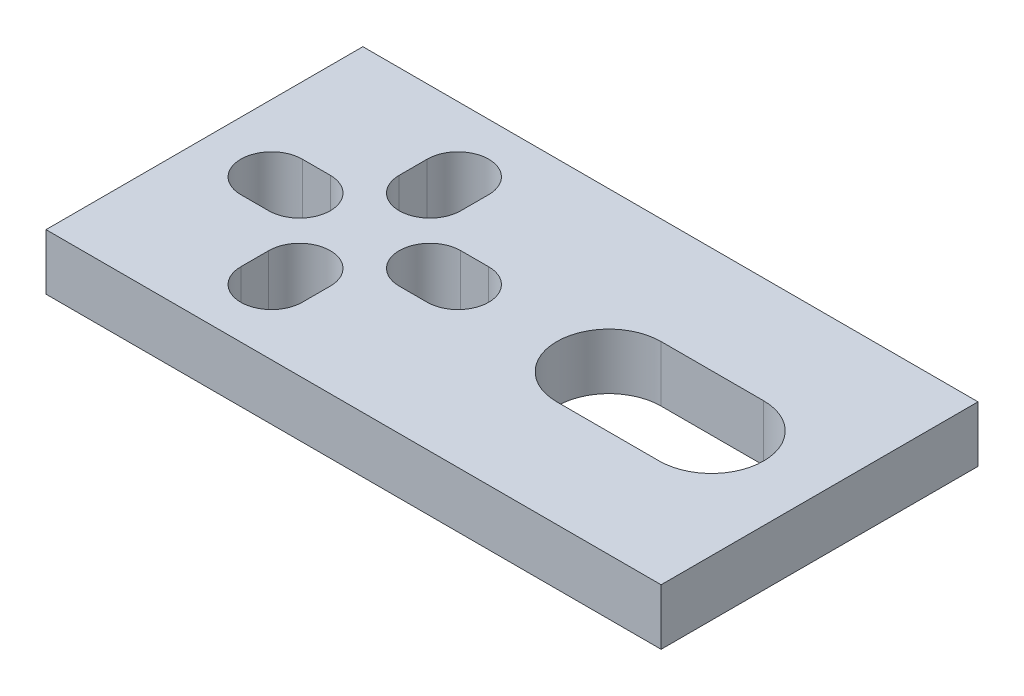
ISO-10303-21;
HEADER;
FILE_DESCRIPTION(('STEP AP214'),'2;1');
FILE_NAME('part.step','',(''),(''),'','','');
FILE_SCHEMA(('AUTOMOTIVE_DESIGN { 1 0 10303 214 1 1 1 1 }'));
ENDSEC;
DATA;
#1=APPLICATION_CONTEXT('core data for automotive mechanical design processes');
#2=APPLICATION_PROTOCOL_DEFINITION('international standard','automotive_design',2000,#1);
#3=PRODUCT_CONTEXT('',#1,'mechanical');
#4=PRODUCT('Part','Part','',(#3));
#5=PRODUCT_RELATED_PRODUCT_CATEGORY('part','',(#4));
#6=PRODUCT_DEFINITION_FORMATION('','',#4);
#7=PRODUCT_DEFINITION_CONTEXT('part definition',#1,'design');
#8=PRODUCT_DEFINITION('design','',#6,#7);
#9=PRODUCT_DEFINITION_SHAPE('','',#8);
#10=(LENGTH_UNIT() NAMED_UNIT(*) SI_UNIT(.MILLI.,.METRE.));
#11=(NAMED_UNIT(*) PLANE_ANGLE_UNIT() SI_UNIT($,.RADIAN.));
#12=(NAMED_UNIT(*) SI_UNIT($,.STERADIAN.) SOLID_ANGLE_UNIT());
#13=UNCERTAINTY_MEASURE_WITH_UNIT(LENGTH_MEASURE(1.E-05),#10,'distance_accuracy_value','');
#14=(GEOMETRIC_REPRESENTATION_CONTEXT(3) GLOBAL_UNCERTAINTY_ASSIGNED_CONTEXT((#13)) GLOBAL_UNIT_ASSIGNED_CONTEXT((#10,
#11,#12)) REPRESENTATION_CONTEXT('',''));
#15=CARTESIAN_POINT('',(0.,0.,0.));
#16=DIRECTION('',(0.,0.,1.));
#17=DIRECTION('',(1.,0.,0.));
#18=AXIS2_PLACEMENT_3D('',#15,#16,#17);
#19=CARTESIAN_POINT('',(0.,3.,0.));
#20=DIRECTION('',(1.,0.,0.));
#21=DIRECTION('',(0.,0.,-1.));
#22=AXIS2_PLACEMENT_3D('',#19,#20,#21);
#23=PLANE('',#22);
#24=DIRECTION('',(0.,0.,1.));
#25=VECTOR('',#24,1.);
#26=CARTESIAN_POINT('',(0.,0.,0.));
#27=LINE('',#26,#25);
#28=CARTESIAN_POINT('',(0.,0.,-17.));
#29=VERTEX_POINT('',#28);
#30=CARTESIAN_POINT('',(0.,0.,0.));
#31=VERTEX_POINT('',#30);
#32=EDGE_CURVE('E353',#29,#31,#27,.T.);
#33=ORIENTED_EDGE('',*,*,#32,.T.);
#34=DIRECTION('',(0.,-1.,0.));
#35=VECTOR('',#34,1.);
#36=CARTESIAN_POINT('',(0.,3.,0.));
#37=LINE('',#36,#35);
#38=CARTESIAN_POINT('',(0.,3.,0.));
#39=VERTEX_POINT('',#38);
#40=EDGE_CURVE('E11',#39,#31,#37,.T.);
#41=ORIENTED_EDGE('',*,*,#40,.F.);
#42=DIRECTION('',(0.,0.,1.));
#43=VECTOR('',#42,1.);
#44=CARTESIAN_POINT('',(0.,3.,0.));
#45=LINE('',#44,#43);
#46=CARTESIAN_POINT('',(0.,3.,-17.));
#47=VERTEX_POINT('',#46);
#48=EDGE_CURVE('E360',#47,#39,#45,.T.);
#49=ORIENTED_EDGE('',*,*,#48,.F.);
#50=DIRECTION('',(0.,-1.,0.));
#51=VECTOR('',#50,1.);
#52=CARTESIAN_POINT('',(0.,3.,-17.));
#53=LINE('',#52,#51);
#54=EDGE_CURVE('E370',#47,#29,#53,.T.);
#55=ORIENTED_EDGE('',*,*,#54,.T.);
#56=EDGE_LOOP('',(#33,#41,#49,#55));
#57=FACE_BOUND('',#56,.T.);
#58=ADVANCED_FACE('F35',(#57),#23,.F.);
#59=CARTESIAN_POINT('',(0.,3.,0.));
#60=DIRECTION('',(0.,0.,-1.));
#61=DIRECTION('',(-1.,0.,0.));
#62=AXIS2_PLACEMENT_3D('',#59,#60,#61);
#63=PLANE('',#62);
#64=DIRECTION('',(1.,0.,0.));
#65=VECTOR('',#64,1.);
#66=CARTESIAN_POINT('',(0.,0.,0.));
#67=LINE('',#66,#65);
#68=CARTESIAN_POINT('',(33.,0.,0.));
#69=VERTEX_POINT('',#68);
#70=EDGE_CURVE('E373',#31,#69,#67,.T.);
#71=ORIENTED_EDGE('',*,*,#70,.T.);
#72=DIRECTION('',(0.,-1.,0.));
#73=VECTOR('',#72,1.);
#74=CARTESIAN_POINT('',(33.,3.,0.));
#75=LINE('',#74,#73);
#76=CARTESIAN_POINT('',(33.,3.,0.));
#77=VERTEX_POINT('',#76);
#78=EDGE_CURVE('E42',#77,#69,#75,.T.);
#79=ORIENTED_EDGE('',*,*,#78,.F.);
#80=DIRECTION('',(1.,0.,0.));
#81=VECTOR('',#80,1.);
#82=CARTESIAN_POINT('',(0.,3.,0.));
#83=LINE('',#82,#81);
#84=EDGE_CURVE('E363',#39,#77,#83,.T.);
#85=ORIENTED_EDGE('',*,*,#84,.F.);
#86=ORIENTED_EDGE('',*,*,#40,.T.);
#87=EDGE_LOOP('',(#71,#79,#85,#86));
#88=FACE_BOUND('',#87,.T.);
#89=ADVANCED_FACE('F402',(#88),#63,.F.);
#90=CARTESIAN_POINT('',(33.,3.,0.));
#91=DIRECTION('',(-1.,0.,0.));
#92=DIRECTION('',(0.,0.,1.));
#93=AXIS2_PLACEMENT_3D('',#90,#91,#92);
#94=PLANE('',#93);
#95=DIRECTION('',(0.,0.,-1.));
#96=VECTOR('',#95,1.);
#97=CARTESIAN_POINT('',(33.,0.,0.));
#98=LINE('',#97,#96);
#99=CARTESIAN_POINT('',(33.,0.,-17.));
#100=VERTEX_POINT('',#99);
#101=EDGE_CURVE('E375',#69,#100,#98,.T.);
#102=ORIENTED_EDGE('',*,*,#101,.T.);
#103=DIRECTION('',(0.,-1.,0.));
#104=VECTOR('',#103,1.);
#105=CARTESIAN_POINT('',(33.,3.,-17.));
#106=LINE('',#105,#104);
#107=CARTESIAN_POINT('',(33.,3.,-17.));
#108=VERTEX_POINT('',#107);
#109=EDGE_CURVE('E380',#108,#100,#106,.T.);
#110=ORIENTED_EDGE('',*,*,#109,.F.);
#111=DIRECTION('',(0.,0.,-1.));
#112=VECTOR('',#111,1.);
#113=CARTESIAN_POINT('',(33.,3.,0.));
#114=LINE('',#113,#112);
#115=EDGE_CURVE('E366',#77,#108,#114,.T.);
#116=ORIENTED_EDGE('',*,*,#115,.F.);
#117=ORIENTED_EDGE('',*,*,#78,.T.);
#118=EDGE_LOOP('',(#102,#110,#116,#117));
#119=FACE_BOUND('',#118,.T.);
#120=ADVANCED_FACE('F387',(#119),#94,.F.);
#121=CARTESIAN_POINT('',(0.,3.,-17.));
#122=DIRECTION('',(0.,0.,1.));
#123=DIRECTION('',(1.,0.,0.));
#124=AXIS2_PLACEMENT_3D('',#121,#122,#123);
#125=PLANE('',#124);
#126=DIRECTION('',(-1.,0.,0.));
#127=VECTOR('',#126,1.);
#128=CARTESIAN_POINT('',(0.,0.,-17.));
#129=LINE('',#128,#127);
#130=EDGE_CURVE('E364',#100,#29,#129,.T.);
#131=ORIENTED_EDGE('',*,*,#130,.T.);
#132=ORIENTED_EDGE('',*,*,#54,.F.);
#133=DIRECTION('',(-1.,0.,0.));
#134=VECTOR('',#133,1.);
#135=CARTESIAN_POINT('',(0.,3.,-17.));
#136=LINE('',#135,#134);
#137=EDGE_CURVE('E368',#108,#47,#136,.T.);
#138=ORIENTED_EDGE('',*,*,#137,.F.);
#139=ORIENTED_EDGE('',*,*,#109,.T.);
#140=EDGE_LOOP('',(#131,#132,#138,#139));
#141=FACE_BOUND('',#140,.T.);
#142=ADVANCED_FACE('F395',(#141),#125,.F.);
#143=CARTESIAN_POINT('',(0.,3.,0.));
#144=DIRECTION('',(0.,-1.,0.));
#145=DIRECTION('',(0.,0.,-1.));
#146=AXIS2_PLACEMENT_3D('',#143,#144,#145);
#147=PLANE('',#146);
#148=DIRECTION('',(0.,0.,1.));
#149=VECTOR('',#148,1.);
#150=CARTESIAN_POINT('',(6.94999999999999,3.,-5.));
#151=LINE('',#150,#149);
#152=CARTESIAN_POINT('',(6.94999999999999,3.,-5.));
#153=VERTEX_POINT('',#152);
#154=CARTESIAN_POINT('',(6.94999999999999,3.,-3.5));
#155=VERTEX_POINT('',#154);
#156=EDGE_CURVE('E222',#153,#155,#151,.T.);
#157=ORIENTED_EDGE('',*,*,#156,.F.);
#158=CARTESIAN_POINT('',(8.6,3.,-5.));
#159=DIRECTION('',(0.,1.,0.));
#160=DIRECTION('',(0.,0.,-1.));
#161=AXIS2_PLACEMENT_3D('',#158,#159,#160);
#162=CIRCLE('',#161,1.65000000000001);
#163=CARTESIAN_POINT('',(10.25,3.,-5.));
#164=VERTEX_POINT('',#163);
#165=EDGE_CURVE('E49',#164,#153,#162,.T.);
#166=ORIENTED_EDGE('',*,*,#165,.F.);
#167=DIRECTION('',(0.,0.,-1.));
#168=VECTOR('',#167,1.);
#169=CARTESIAN_POINT('',(10.25,3.,-5.));
#170=LINE('',#169,#168);
#171=CARTESIAN_POINT('',(10.25,3.,-3.5));
#172=VERTEX_POINT('',#171);
#173=EDGE_CURVE('E213',#172,#164,#170,.T.);
#174=ORIENTED_EDGE('',*,*,#173,.F.);
#175=CARTESIAN_POINT('',(8.6,3.,-3.5));
#176=DIRECTION('',(0.,1.,0.));
#177=DIRECTION('',(0.,0.,-1.));
#178=AXIS2_PLACEMENT_3D('',#175,#176,#177);
#179=CIRCLE('',#178,1.65);
#180=EDGE_CURVE('E216',#155,#172,#179,.T.);
#181=ORIENTED_EDGE('',*,*,#180,.F.);
#182=EDGE_LOOP('',(#157,#166,#174,#181));
#183=FACE_BOUND('',#182,.T.);
#184=DIRECTION('',(-1.,0.,0.));
#185=VECTOR('',#184,1.);
#186=CARTESIAN_POINT('',(13.6,3.,-10.15));
#187=LINE('',#186,#185);
#188=CARTESIAN_POINT('',(13.6,3.,-10.15));
#189=VERTEX_POINT('',#188);
#190=CARTESIAN_POINT('',(12.1,3.,-10.15));
#191=VERTEX_POINT('',#190);
#192=EDGE_CURVE('E247',#189,#191,#187,.T.);
#193=ORIENTED_EDGE('',*,*,#192,.F.);
#194=CARTESIAN_POINT('',(13.6,3.,-8.5));
#195=DIRECTION('',(0.,1.,0.));
#196=DIRECTION('',(0.,0.,-1.));
#197=AXIS2_PLACEMENT_3D('',#194,#195,#196);
#198=CIRCLE('',#197,1.65);
#199=CARTESIAN_POINT('',(13.6,3.,-6.85));
#200=VERTEX_POINT('',#199);
#201=EDGE_CURVE('E228',#200,#189,#198,.T.);
#202=ORIENTED_EDGE('',*,*,#201,.F.);
#203=DIRECTION('',(1.,0.,0.));
#204=VECTOR('',#203,1.);
#205=CARTESIAN_POINT('',(13.6,3.,-6.85));
#206=LINE('',#205,#204);
#207=CARTESIAN_POINT('',(12.1,3.,-6.85));
#208=VERTEX_POINT('',#207);
#209=EDGE_CURVE('E236',#208,#200,#206,.T.);
#210=ORIENTED_EDGE('',*,*,#209,.F.);
#211=CARTESIAN_POINT('',(12.1,3.,-8.5));
#212=DIRECTION('',(0.,1.,0.));
#213=DIRECTION('',(0.,0.,-1.));
#214=AXIS2_PLACEMENT_3D('',#211,#212,#213);
#215=CIRCLE('',#214,1.65);
#216=EDGE_CURVE('E250',#191,#208,#215,.T.);
#217=ORIENTED_EDGE('',*,*,#216,.F.);
#218=EDGE_LOOP('',(#193,#202,#210,#217));
#219=FACE_BOUND('',#218,.T.);
#220=DIRECTION('',(1.,0.,0.));
#221=VECTOR('',#220,1.);
#222=CARTESIAN_POINT('',(3.6,3.,-6.85));
#223=LINE('',#222,#221);
#224=CARTESIAN_POINT('',(3.6,3.,-6.85));
#225=VERTEX_POINT('',#224);
#226=CARTESIAN_POINT('',(5.1,3.,-6.85));
#227=VERTEX_POINT('',#226);
#228=EDGE_CURVE('E279',#225,#227,#223,.T.);
#229=ORIENTED_EDGE('',*,*,#228,.F.);
#230=CARTESIAN_POINT('',(3.6,3.,-8.5));
#231=DIRECTION('',(0.,1.,0.));
#232=DIRECTION('',(0.,0.,1.));
#233=AXIS2_PLACEMENT_3D('',#230,#231,#232);
#234=CIRCLE('',#233,1.65);
#235=CARTESIAN_POINT('',(3.6,3.,-10.15));
#236=VERTEX_POINT('',#235);
#237=EDGE_CURVE('E257',#236,#225,#234,.T.);
#238=ORIENTED_EDGE('',*,*,#237,.F.);
#239=DIRECTION('',(-1.,0.,0.));
#240=VECTOR('',#239,1.);
#241=CARTESIAN_POINT('',(3.6,3.,-10.15));
#242=LINE('',#241,#240);
#243=CARTESIAN_POINT('',(5.1,3.,-10.15));
#244=VERTEX_POINT('',#243);
#245=EDGE_CURVE('E268',#244,#236,#242,.T.);
#246=ORIENTED_EDGE('',*,*,#245,.F.);
#247=CARTESIAN_POINT('',(5.1,3.,-8.5));
#248=DIRECTION('',(0.,1.,0.));
#249=DIRECTION('',(0.,0.,1.));
#250=AXIS2_PLACEMENT_3D('',#247,#248,#249);
#251=CIRCLE('',#250,1.65);
#252=EDGE_CURVE('E282',#227,#244,#251,.T.);
#253=ORIENTED_EDGE('',*,*,#252,.F.);
#254=EDGE_LOOP('',(#229,#238,#246,#253));
#255=FACE_BOUND('',#254,.T.);
#256=DIRECTION('',(0.,0.,-1.));
#257=VECTOR('',#256,1.);
#258=CARTESIAN_POINT('',(10.25,3.,-12.));
#259=LINE('',#258,#257);
#260=CARTESIAN_POINT('',(10.25,3.,-12.));
#261=VERTEX_POINT('',#260);
#262=CARTESIAN_POINT('',(10.25,3.,-13.5));
#263=VERTEX_POINT('',#262);
#264=EDGE_CURVE('E311',#261,#263,#259,.T.);
#265=ORIENTED_EDGE('',*,*,#264,.F.);
#266=CARTESIAN_POINT('',(8.6,3.,-12.));
#267=DIRECTION('',(0.,1.,0.));
#268=DIRECTION('',(0.,0.,1.));
#269=AXIS2_PLACEMENT_3D('',#266,#267,#268);
#270=CIRCLE('',#269,1.65000000000001);
#271=CARTESIAN_POINT('',(6.94999999999999,3.,-12.));
#272=VERTEX_POINT('',#271);
#273=EDGE_CURVE('E289',#272,#261,#270,.T.);
#274=ORIENTED_EDGE('',*,*,#273,.F.);
#275=DIRECTION('',(0.,0.,1.));
#276=VECTOR('',#275,1.);
#277=CARTESIAN_POINT('',(6.94999999999999,3.,-12.));
#278=LINE('',#277,#276);
#279=CARTESIAN_POINT('',(6.94999999999999,3.,-13.5));
#280=VERTEX_POINT('',#279);
#281=EDGE_CURVE('E300',#280,#272,#278,.T.);
#282=ORIENTED_EDGE('',*,*,#281,.F.);
#283=CARTESIAN_POINT('',(8.6,3.,-13.5));
#284=DIRECTION('',(0.,1.,0.));
#285=DIRECTION('',(0.,0.,1.));
#286=AXIS2_PLACEMENT_3D('',#283,#284,#285);
#287=CIRCLE('',#286,1.65);
#288=EDGE_CURVE('E314',#263,#280,#287,.T.);
#289=ORIENTED_EDGE('',*,*,#288,.F.);
#290=EDGE_LOOP('',(#265,#274,#282,#289));
#291=FACE_BOUND('',#290,.T.);
#292=DIRECTION('',(1.,0.,0.));
#293=VECTOR('',#292,1.);
#294=CARTESIAN_POINT('',(21.7,3.,-5.7));
#295=LINE('',#294,#293);
#296=CARTESIAN_POINT('',(21.7,3.,-5.7));
#297=VERTEX_POINT('',#296);
#298=CARTESIAN_POINT('',(27.2,3.,-5.7));
#299=VERTEX_POINT('',#298);
#300=EDGE_CURVE('E343',#297,#299,#295,.T.);
#301=ORIENTED_EDGE('',*,*,#300,.F.);
#302=CARTESIAN_POINT('',(21.7,3.,-8.5));
#303=DIRECTION('',(0.,1.,0.));
#304=DIRECTION('',(0.,0.,1.));
#305=AXIS2_PLACEMENT_3D('',#302,#303,#304);
#306=CIRCLE('',#305,2.8);
#307=CARTESIAN_POINT('',(21.7,3.,-11.3));
#308=VERTEX_POINT('',#307);
#309=EDGE_CURVE('E321',#308,#297,#306,.T.);
#310=ORIENTED_EDGE('',*,*,#309,.F.);
#311=DIRECTION('',(-1.,0.,0.));
#312=VECTOR('',#311,1.);
#313=CARTESIAN_POINT('',(21.7,3.,-11.3));
#314=LINE('',#313,#312);
#315=CARTESIAN_POINT('',(27.2,3.,-11.3));
#316=VERTEX_POINT('',#315);
#317=EDGE_CURVE('E332',#316,#308,#314,.T.);
#318=ORIENTED_EDGE('',*,*,#317,.F.);
#319=CARTESIAN_POINT('',(27.2,3.,-8.5));
#320=DIRECTION('',(0.,1.,0.));
#321=DIRECTION('',(0.,0.,1.));
#322=AXIS2_PLACEMENT_3D('',#319,#320,#321);
#323=CIRCLE('',#322,2.8);
#324=EDGE_CURVE('E346',#299,#316,#323,.T.);
#325=ORIENTED_EDGE('',*,*,#324,.F.);
#326=EDGE_LOOP('',(#301,#310,#318,#325));
#327=FACE_BOUND('',#326,.T.);
#328=ORIENTED_EDGE('',*,*,#48,.T.);
#329=ORIENTED_EDGE('',*,*,#84,.T.);
#330=ORIENTED_EDGE('',*,*,#115,.T.);
#331=ORIENTED_EDGE('',*,*,#137,.T.);
#332=EDGE_LOOP('',(#328,#329,#330,#331));
#333=FACE_BOUND('',#332,.T.);
#334=ADVANCED_FACE('F401',(#183,#219,#255,#291,#327,#333),#147,.F.);
#335=CARTESIAN_POINT('',(0.,0.,0.));
#336=DIRECTION('',(0.,-1.,0.));
#337=DIRECTION('',(0.,0.,-1.));
#338=AXIS2_PLACEMENT_3D('',#335,#336,#337);
#339=PLANE('',#338);
#340=CARTESIAN_POINT('',(8.6,0.,-5.));
#341=DIRECTION('',(0.,1.,0.));
#342=DIRECTION('',(0.,0.,-1.));
#343=AXIS2_PLACEMENT_3D('',#340,#341,#342);
#344=CIRCLE('',#343,1.65000000000001);
#345=CARTESIAN_POINT('',(10.25,0.,-5.));
#346=VERTEX_POINT('',#345);
#347=CARTESIAN_POINT('',(6.94999999999999,0.,-5.));
#348=VERTEX_POINT('',#347);
#349=EDGE_CURVE('E197',#346,#348,#344,.T.);
#350=ORIENTED_EDGE('',*,*,#349,.T.);
#351=DIRECTION('',(0.,0.,1.));
#352=VECTOR('',#351,1.);
#353=CARTESIAN_POINT('',(6.94999999999999,0.,-5.));
#354=LINE('',#353,#352);
#355=CARTESIAN_POINT('',(6.94999999999999,0.,-3.5));
#356=VERTEX_POINT('',#355);
#357=EDGE_CURVE('E206',#348,#356,#354,.T.);
#358=ORIENTED_EDGE('',*,*,#357,.T.);
#359=CARTESIAN_POINT('',(8.6,0.,-3.5));
#360=DIRECTION('',(0.,1.,0.));
#361=DIRECTION('',(0.,0.,-1.));
#362=AXIS2_PLACEMENT_3D('',#359,#360,#361);
#363=CIRCLE('',#362,1.65);
#364=CARTESIAN_POINT('',(10.25,0.,-3.5));
#365=VERTEX_POINT('',#364);
#366=EDGE_CURVE('E57',#356,#365,#363,.T.);
#367=ORIENTED_EDGE('',*,*,#366,.T.);
#368=DIRECTION('',(0.,0.,-1.));
#369=VECTOR('',#368,1.);
#370=CARTESIAN_POINT('',(10.25,0.,-5.));
#371=LINE('',#370,#369);
#372=EDGE_CURVE('E203',#365,#346,#371,.T.);
#373=ORIENTED_EDGE('',*,*,#372,.T.);
#374=EDGE_LOOP('',(#350,#358,#367,#373));
#375=FACE_BOUND('',#374,.T.);
#376=CARTESIAN_POINT('',(13.6,0.,-8.5));
#377=DIRECTION('',(0.,1.,0.));
#378=DIRECTION('',(0.,0.,-1.));
#379=AXIS2_PLACEMENT_3D('',#376,#377,#378);
#380=CIRCLE('',#379,1.65);
#381=CARTESIAN_POINT('',(13.6,0.,-6.85));
#382=VERTEX_POINT('',#381);
#383=CARTESIAN_POINT('',(13.6,0.,-10.15));
#384=VERTEX_POINT('',#383);
#385=EDGE_CURVE('E232',#382,#384,#380,.T.);
#386=ORIENTED_EDGE('',*,*,#385,.T.);
#387=DIRECTION('',(-1.,0.,0.));
#388=VECTOR('',#387,1.);
#389=CARTESIAN_POINT('',(13.6,0.,-10.15));
#390=LINE('',#389,#388);
#391=CARTESIAN_POINT('',(12.1,0.,-10.15));
#392=VERTEX_POINT('',#391);
#393=EDGE_CURVE('E235',#384,#392,#390,.T.);
#394=ORIENTED_EDGE('',*,*,#393,.T.);
#395=CARTESIAN_POINT('',(12.1,0.,-8.5));
#396=DIRECTION('',(0.,1.,0.));
#397=DIRECTION('',(0.,0.,-1.));
#398=AXIS2_PLACEMENT_3D('',#395,#396,#397);
#399=CIRCLE('',#398,1.65);
#400=CARTESIAN_POINT('',(12.1,0.,-6.85));
#401=VERTEX_POINT('',#400);
#402=EDGE_CURVE('E239',#392,#401,#399,.T.);
#403=ORIENTED_EDGE('',*,*,#402,.T.);
#404=DIRECTION('',(1.,0.,0.));
#405=VECTOR('',#404,1.);
#406=CARTESIAN_POINT('',(13.6,0.,-6.85));
#407=LINE('',#406,#405);
#408=EDGE_CURVE('E242',#401,#382,#407,.T.);
#409=ORIENTED_EDGE('',*,*,#408,.T.);
#410=EDGE_LOOP('',(#386,#394,#403,#409));
#411=FACE_BOUND('',#410,.T.);
#412=CARTESIAN_POINT('',(3.6,0.,-8.5));
#413=DIRECTION('',(0.,1.,0.));
#414=DIRECTION('',(0.,0.,1.));
#415=AXIS2_PLACEMENT_3D('',#412,#413,#414);
#416=CIRCLE('',#415,1.65);
#417=CARTESIAN_POINT('',(3.6,0.,-10.15));
#418=VERTEX_POINT('',#417);
#419=CARTESIAN_POINT('',(3.6,0.,-6.85));
#420=VERTEX_POINT('',#419);
#421=EDGE_CURVE('E264',#418,#420,#416,.T.);
#422=ORIENTED_EDGE('',*,*,#421,.T.);
#423=DIRECTION('',(1.,0.,0.));
#424=VECTOR('',#423,1.);
#425=CARTESIAN_POINT('',(3.6,0.,-6.85));
#426=LINE('',#425,#424);
#427=CARTESIAN_POINT('',(5.1,0.,-6.85));
#428=VERTEX_POINT('',#427);
#429=EDGE_CURVE('E267',#420,#428,#426,.T.);
#430=ORIENTED_EDGE('',*,*,#429,.T.);
#431=CARTESIAN_POINT('',(5.1,0.,-8.5));
#432=DIRECTION('',(0.,1.,0.));
#433=DIRECTION('',(0.,0.,1.));
#434=AXIS2_PLACEMENT_3D('',#431,#432,#433);
#435=CIRCLE('',#434,1.65);
#436=CARTESIAN_POINT('',(5.1,0.,-10.15));
#437=VERTEX_POINT('',#436);
#438=EDGE_CURVE('E271',#428,#437,#435,.T.);
#439=ORIENTED_EDGE('',*,*,#438,.T.);
#440=DIRECTION('',(-1.,0.,0.));
#441=VECTOR('',#440,1.);
#442=CARTESIAN_POINT('',(3.6,0.,-10.15));
#443=LINE('',#442,#441);
#444=EDGE_CURVE('E274',#437,#418,#443,.T.);
#445=ORIENTED_EDGE('',*,*,#444,.T.);
#446=EDGE_LOOP('',(#422,#430,#439,#445));
#447=FACE_BOUND('',#446,.T.);
#448=CARTESIAN_POINT('',(8.6,0.,-12.));
#449=DIRECTION('',(0.,1.,0.));
#450=DIRECTION('',(0.,0.,1.));
#451=AXIS2_PLACEMENT_3D('',#448,#449,#450);
#452=CIRCLE('',#451,1.65000000000001);
#453=CARTESIAN_POINT('',(6.94999999999999,0.,-12.));
#454=VERTEX_POINT('',#453);
#455=CARTESIAN_POINT('',(10.25,0.,-12.));
#456=VERTEX_POINT('',#455);
#457=EDGE_CURVE('E296',#454,#456,#452,.T.);
#458=ORIENTED_EDGE('',*,*,#457,.T.);
#459=DIRECTION('',(0.,0.,-1.));
#460=VECTOR('',#459,1.);
#461=CARTESIAN_POINT('',(10.25,0.,-12.));
#462=LINE('',#461,#460);
#463=CARTESIAN_POINT('',(10.25,0.,-13.5));
#464=VERTEX_POINT('',#463);
#465=EDGE_CURVE('E299',#456,#464,#462,.T.);
#466=ORIENTED_EDGE('',*,*,#465,.T.);
#467=CARTESIAN_POINT('',(8.6,0.,-13.5));
#468=DIRECTION('',(0.,1.,0.));
#469=DIRECTION('',(0.,0.,1.));
#470=AXIS2_PLACEMENT_3D('',#467,#468,#469);
#471=CIRCLE('',#470,1.65);
#472=CARTESIAN_POINT('',(6.94999999999999,0.,-13.5));
#473=VERTEX_POINT('',#472);
#474=EDGE_CURVE('E303',#464,#473,#471,.T.);
#475=ORIENTED_EDGE('',*,*,#474,.T.);
#476=DIRECTION('',(0.,0.,1.));
#477=VECTOR('',#476,1.);
#478=CARTESIAN_POINT('',(6.94999999999999,0.,-12.));
#479=LINE('',#478,#477);
#480=EDGE_CURVE('E306',#473,#454,#479,.T.);
#481=ORIENTED_EDGE('',*,*,#480,.T.);
#482=EDGE_LOOP('',(#458,#466,#475,#481));
#483=FACE_BOUND('',#482,.T.);
#484=CARTESIAN_POINT('',(21.7,0.,-8.5));
#485=DIRECTION('',(0.,1.,0.));
#486=DIRECTION('',(0.,0.,1.));
#487=AXIS2_PLACEMENT_3D('',#484,#485,#486);
#488=CIRCLE('',#487,2.8);
#489=CARTESIAN_POINT('',(21.7,0.,-11.3));
#490=VERTEX_POINT('',#489);
#491=CARTESIAN_POINT('',(21.7,0.,-5.7));
#492=VERTEX_POINT('',#491);
#493=EDGE_CURVE('E328',#490,#492,#488,.T.);
#494=ORIENTED_EDGE('',*,*,#493,.T.);
#495=DIRECTION('',(1.,0.,0.));
#496=VECTOR('',#495,1.);
#497=CARTESIAN_POINT('',(21.7,0.,-5.7));
#498=LINE('',#497,#496);
#499=CARTESIAN_POINT('',(27.2,0.,-5.7));
#500=VERTEX_POINT('',#499);
#501=EDGE_CURVE('E331',#492,#500,#498,.T.);
#502=ORIENTED_EDGE('',*,*,#501,.T.);
#503=CARTESIAN_POINT('',(27.2,0.,-8.5));
#504=DIRECTION('',(0.,1.,0.));
#505=DIRECTION('',(0.,0.,1.));
#506=AXIS2_PLACEMENT_3D('',#503,#504,#505);
#507=CIRCLE('',#506,2.8);
#508=CARTESIAN_POINT('',(27.2,0.,-11.3));
#509=VERTEX_POINT('',#508);
#510=EDGE_CURVE('E335',#500,#509,#507,.T.);
#511=ORIENTED_EDGE('',*,*,#510,.T.);
#512=DIRECTION('',(-1.,0.,0.));
#513=VECTOR('',#512,1.);
#514=CARTESIAN_POINT('',(21.7,0.,-11.3));
#515=LINE('',#514,#513);
#516=EDGE_CURVE('E338',#509,#490,#515,.T.);
#517=ORIENTED_EDGE('',*,*,#516,.T.);
#518=EDGE_LOOP('',(#494,#502,#511,#517));
#519=FACE_BOUND('',#518,.T.);
#520=ORIENTED_EDGE('',*,*,#32,.F.);
#521=ORIENTED_EDGE('',*,*,#130,.F.);
#522=ORIENTED_EDGE('',*,*,#101,.F.);
#523=ORIENTED_EDGE('',*,*,#70,.F.);
#524=EDGE_LOOP('',(#520,#521,#522,#523));
#525=FACE_BOUND('',#524,.T.);
#526=ADVANCED_FACE('F210',(#375,#411,#447,#483,#519,#525),#339,.T.);
#527=CARTESIAN_POINT('',(21.7,0.,-8.5));
#528=DIRECTION('',(0.,1.,0.));
#529=DIRECTION('',(0.,0.,1.));
#530=AXIS2_PLACEMENT_3D('',#527,#528,#529);
#531=CYLINDRICAL_SURFACE('',#530,2.8);
#532=ORIENTED_EDGE('',*,*,#309,.T.);
#533=DIRECTION('',(0.,1.,0.));
#534=VECTOR('',#533,1.);
#535=CARTESIAN_POINT('',(21.7,0.,-5.7));
#536=LINE('',#535,#534);
#537=EDGE_CURVE('E341',#492,#297,#536,.T.);
#538=ORIENTED_EDGE('',*,*,#537,.F.);
#539=ORIENTED_EDGE('',*,*,#493,.F.);
#540=DIRECTION('',(0.,1.,0.));
#541=VECTOR('',#540,1.);
#542=CARTESIAN_POINT('',(21.7,0.,-11.3));
#543=LINE('',#542,#541);
#544=EDGE_CURVE('E351',#490,#308,#543,.T.);
#545=ORIENTED_EDGE('',*,*,#544,.T.);
#546=EDGE_LOOP('',(#532,#538,#539,#545));
#547=FACE_BOUND('',#546,.T.);
#548=ADVANCED_FACE('F414',(#547),#531,.F.);
#549=CARTESIAN_POINT('',(21.7,0.,-11.3));
#550=DIRECTION('',(0.,0.,-1.));
#551=DIRECTION('',(-1.,0.,0.));
#552=AXIS2_PLACEMENT_3D('',#549,#550,#551);
#553=PLANE('',#552);
#554=ORIENTED_EDGE('',*,*,#317,.T.);
#555=ORIENTED_EDGE('',*,*,#544,.F.);
#556=ORIENTED_EDGE('',*,*,#516,.F.);
#557=DIRECTION('',(0.,1.,0.));
#558=VECTOR('',#557,1.);
#559=CARTESIAN_POINT('',(27.2,0.,-11.3));
#560=LINE('',#559,#558);
#561=EDGE_CURVE('E354',#509,#316,#560,.T.);
#562=ORIENTED_EDGE('',*,*,#561,.T.);
#563=EDGE_LOOP('',(#554,#555,#556,#562));
#564=FACE_BOUND('',#563,.T.);
#565=ADVANCED_FACE('F420',(#564),#553,.F.);
#566=CARTESIAN_POINT('',(27.2,0.,-8.5));
#567=DIRECTION('',(0.,1.,0.));
#568=DIRECTION('',(0.,0.,1.));
#569=AXIS2_PLACEMENT_3D('',#566,#567,#568);
#570=CYLINDRICAL_SURFACE('',#569,2.8);
#571=ORIENTED_EDGE('',*,*,#324,.T.);
#572=ORIENTED_EDGE('',*,*,#561,.F.);
#573=ORIENTED_EDGE('',*,*,#510,.F.);
#574=DIRECTION('',(0.,1.,0.));
#575=VECTOR('',#574,1.);
#576=CARTESIAN_POINT('',(27.2,0.,-5.7));
#577=LINE('',#576,#575);
#578=EDGE_CURVE('E356',#500,#299,#577,.T.);
#579=ORIENTED_EDGE('',*,*,#578,.T.);
#580=EDGE_LOOP('',(#571,#572,#573,#579));
#581=FACE_BOUND('',#580,.T.);
#582=ADVANCED_FACE('F426',(#581),#570,.F.);
#583=CARTESIAN_POINT('',(21.7,0.,-5.7));
#584=DIRECTION('',(0.,0.,1.));
#585=DIRECTION('',(1.,0.,0.));
#586=AXIS2_PLACEMENT_3D('',#583,#584,#585);
#587=PLANE('',#586);
#588=ORIENTED_EDGE('',*,*,#300,.T.);
#589=ORIENTED_EDGE('',*,*,#578,.F.);
#590=ORIENTED_EDGE('',*,*,#501,.F.);
#591=ORIENTED_EDGE('',*,*,#537,.T.);
#592=EDGE_LOOP('',(#588,#589,#590,#591));
#593=FACE_BOUND('',#592,.T.);
#594=ADVANCED_FACE('F422',(#593),#587,.F.);
#595=CARTESIAN_POINT('',(8.6,0.,-12.));
#596=DIRECTION('',(0.,1.,0.));
#597=DIRECTION('',(0.,0.,1.));
#598=AXIS2_PLACEMENT_3D('',#595,#596,#597);
#599=CYLINDRICAL_SURFACE('',#598,1.65000000000001);
#600=ORIENTED_EDGE('',*,*,#273,.T.);
#601=DIRECTION('',(0.,1.,0.));
#602=VECTOR('',#601,1.);
#603=CARTESIAN_POINT('',(10.25,0.,-12.));
#604=LINE('',#603,#602);
#605=EDGE_CURVE('E309',#456,#261,#604,.T.);
#606=ORIENTED_EDGE('',*,*,#605,.F.);
#607=ORIENTED_EDGE('',*,*,#457,.F.);
#608=DIRECTION('',(0.,1.,0.));
#609=VECTOR('',#608,1.);
#610=CARTESIAN_POINT('',(6.94999999999999,0.,-12.));
#611=LINE('',#610,#609);
#612=EDGE_CURVE('E319',#454,#272,#611,.T.);
#613=ORIENTED_EDGE('',*,*,#612,.T.);
#614=EDGE_LOOP('',(#600,#606,#607,#613));
#615=FACE_BOUND('',#614,.T.);
#616=ADVANCED_FACE('F425',(#615),#599,.F.);
#617=CARTESIAN_POINT('',(6.94999999999999,0.,-12.));
#618=DIRECTION('',(-1.,0.,0.));
#619=DIRECTION('',(0.,0.,1.));
#620=AXIS2_PLACEMENT_3D('',#617,#618,#619);
#621=PLANE('',#620);
#622=ORIENTED_EDGE('',*,*,#281,.T.);
#623=ORIENTED_EDGE('',*,*,#612,.F.);
#624=ORIENTED_EDGE('',*,*,#480,.F.);
#625=DIRECTION('',(0.,1.,0.));
#626=VECTOR('',#625,1.);
#627=CARTESIAN_POINT('',(6.94999999999999,0.,-13.5));
#628=LINE('',#627,#626);
#629=EDGE_CURVE('E322',#473,#280,#628,.T.);
#630=ORIENTED_EDGE('',*,*,#629,.T.);
#631=EDGE_LOOP('',(#622,#623,#624,#630));
#632=FACE_BOUND('',#631,.T.);
#633=ADVANCED_FACE('F436',(#632),#621,.F.);
#634=CARTESIAN_POINT('',(8.6,0.,-13.5));
#635=DIRECTION('',(0.,1.,0.));
#636=DIRECTION('',(0.,0.,1.));
#637=AXIS2_PLACEMENT_3D('',#634,#635,#636);
#638=CYLINDRICAL_SURFACE('',#637,1.65);
#639=ORIENTED_EDGE('',*,*,#288,.T.);
#640=ORIENTED_EDGE('',*,*,#629,.F.);
#641=ORIENTED_EDGE('',*,*,#474,.F.);
#642=DIRECTION('',(0.,1.,0.));
#643=VECTOR('',#642,1.);
#644=CARTESIAN_POINT('',(10.25,0.,-13.5));
#645=LINE('',#644,#643);
#646=EDGE_CURVE('E324',#464,#263,#645,.T.);
#647=ORIENTED_EDGE('',*,*,#646,.T.);
#648=EDGE_LOOP('',(#639,#640,#641,#647));
#649=FACE_BOUND('',#648,.T.);
#650=ADVANCED_FACE('F442',(#649),#638,.F.);
#651=CARTESIAN_POINT('',(10.25,0.,-12.));
#652=DIRECTION('',(1.,0.,0.));
#653=DIRECTION('',(0.,0.,-1.));
#654=AXIS2_PLACEMENT_3D('',#651,#652,#653);
#655=PLANE('',#654);
#656=ORIENTED_EDGE('',*,*,#264,.T.);
#657=ORIENTED_EDGE('',*,*,#646,.F.);
#658=ORIENTED_EDGE('',*,*,#465,.F.);
#659=ORIENTED_EDGE('',*,*,#605,.T.);
#660=EDGE_LOOP('',(#656,#657,#658,#659));
#661=FACE_BOUND('',#660,.T.);
#662=ADVANCED_FACE('F438',(#661),#655,.F.);
#663=CARTESIAN_POINT('',(3.6,0.,-8.5));
#664=DIRECTION('',(0.,1.,0.));
#665=DIRECTION('',(0.,0.,1.));
#666=AXIS2_PLACEMENT_3D('',#663,#664,#665);
#667=CYLINDRICAL_SURFACE('',#666,1.65);
#668=ORIENTED_EDGE('',*,*,#237,.T.);
#669=DIRECTION('',(0.,1.,0.));
#670=VECTOR('',#669,1.);
#671=CARTESIAN_POINT('',(3.6,0.,-6.85));
#672=LINE('',#671,#670);
#673=EDGE_CURVE('E277',#420,#225,#672,.T.);
#674=ORIENTED_EDGE('',*,*,#673,.F.);
#675=ORIENTED_EDGE('',*,*,#421,.F.);
#676=DIRECTION('',(0.,1.,0.));
#677=VECTOR('',#676,1.);
#678=CARTESIAN_POINT('',(3.6,0.,-10.15));
#679=LINE('',#678,#677);
#680=EDGE_CURVE('E287',#418,#236,#679,.T.);
#681=ORIENTED_EDGE('',*,*,#680,.T.);
#682=EDGE_LOOP('',(#668,#674,#675,#681));
#683=FACE_BOUND('',#682,.T.);
#684=ADVANCED_FACE('F441',(#683),#667,.F.);
#685=CARTESIAN_POINT('',(3.6,0.,-10.15));
#686=DIRECTION('',(0.,0.,-1.));
#687=DIRECTION('',(-1.,0.,0.));
#688=AXIS2_PLACEMENT_3D('',#685,#686,#687);
#689=PLANE('',#688);
#690=ORIENTED_EDGE('',*,*,#245,.T.);
#691=ORIENTED_EDGE('',*,*,#680,.F.);
#692=ORIENTED_EDGE('',*,*,#444,.F.);
#693=DIRECTION('',(0.,1.,0.));
#694=VECTOR('',#693,1.);
#695=CARTESIAN_POINT('',(5.1,0.,-10.15));
#696=LINE('',#695,#694);
#697=EDGE_CURVE('E290',#437,#244,#696,.T.);
#698=ORIENTED_EDGE('',*,*,#697,.T.);
#699=EDGE_LOOP('',(#690,#691,#692,#698));
#700=FACE_BOUND('',#699,.T.);
#701=ADVANCED_FACE('F452',(#700),#689,.F.);
#702=CARTESIAN_POINT('',(5.1,0.,-8.5));
#703=DIRECTION('',(0.,1.,0.));
#704=DIRECTION('',(0.,0.,1.));
#705=AXIS2_PLACEMENT_3D('',#702,#703,#704);
#706=CYLINDRICAL_SURFACE('',#705,1.65);
#707=ORIENTED_EDGE('',*,*,#252,.T.);
#708=ORIENTED_EDGE('',*,*,#697,.F.);
#709=ORIENTED_EDGE('',*,*,#438,.F.);
#710=DIRECTION('',(0.,1.,0.));
#711=VECTOR('',#710,1.);
#712=CARTESIAN_POINT('',(5.1,0.,-6.85));
#713=LINE('',#712,#711);
#714=EDGE_CURVE('E292',#428,#227,#713,.T.);
#715=ORIENTED_EDGE('',*,*,#714,.T.);
#716=EDGE_LOOP('',(#707,#708,#709,#715));
#717=FACE_BOUND('',#716,.T.);
#718=ADVANCED_FACE('F458',(#717),#706,.F.);
#719=CARTESIAN_POINT('',(3.6,0.,-6.85));
#720=DIRECTION('',(0.,0.,1.));
#721=DIRECTION('',(1.,0.,0.));
#722=AXIS2_PLACEMENT_3D('',#719,#720,#721);
#723=PLANE('',#722);
#724=ORIENTED_EDGE('',*,*,#228,.T.);
#725=ORIENTED_EDGE('',*,*,#714,.F.);
#726=ORIENTED_EDGE('',*,*,#429,.F.);
#727=ORIENTED_EDGE('',*,*,#673,.T.);
#728=EDGE_LOOP('',(#724,#725,#726,#727));
#729=FACE_BOUND('',#728,.T.);
#730=ADVANCED_FACE('F454',(#729),#723,.F.);
#731=CARTESIAN_POINT('',(13.6,0.,-8.5));
#732=DIRECTION('',(0.,1.,0.));
#733=DIRECTION('',(0.,0.,1.));
#734=AXIS2_PLACEMENT_3D('',#731,#732,#733);
#735=CYLINDRICAL_SURFACE('',#734,1.65);
#736=ORIENTED_EDGE('',*,*,#201,.T.);
#737=DIRECTION('',(0.,1.,0.));
#738=VECTOR('',#737,1.);
#739=CARTESIAN_POINT('',(13.6,0.,-10.15));
#740=LINE('',#739,#738);
#741=EDGE_CURVE('E245',#384,#189,#740,.T.);
#742=ORIENTED_EDGE('',*,*,#741,.F.);
#743=ORIENTED_EDGE('',*,*,#385,.F.);
#744=DIRECTION('',(0.,1.,0.));
#745=VECTOR('',#744,1.);
#746=CARTESIAN_POINT('',(13.6,0.,-6.85));
#747=LINE('',#746,#745);
#748=EDGE_CURVE('E255',#382,#200,#747,.T.);
#749=ORIENTED_EDGE('',*,*,#748,.T.);
#750=EDGE_LOOP('',(#736,#742,#743,#749));
#751=FACE_BOUND('',#750,.T.);
#752=ADVANCED_FACE('F457',(#751),#735,.F.);
#753=CARTESIAN_POINT('',(13.6,0.,-6.85));
#754=DIRECTION('',(0.,0.,1.));
#755=DIRECTION('',(1.,0.,0.));
#756=AXIS2_PLACEMENT_3D('',#753,#754,#755);
#757=PLANE('',#756);
#758=ORIENTED_EDGE('',*,*,#209,.T.);
#759=ORIENTED_EDGE('',*,*,#748,.F.);
#760=ORIENTED_EDGE('',*,*,#408,.F.);
#761=DIRECTION('',(0.,1.,0.));
#762=VECTOR('',#761,1.);
#763=CARTESIAN_POINT('',(12.1,0.,-6.85));
#764=LINE('',#763,#762);
#765=EDGE_CURVE('E258',#401,#208,#764,.T.);
#766=ORIENTED_EDGE('',*,*,#765,.T.);
#767=EDGE_LOOP('',(#758,#759,#760,#766));
#768=FACE_BOUND('',#767,.T.);
#769=ADVANCED_FACE('F468',(#768),#757,.F.);
#770=CARTESIAN_POINT('',(12.1,0.,-8.5));
#771=DIRECTION('',(0.,1.,0.));
#772=DIRECTION('',(0.,0.,1.));
#773=AXIS2_PLACEMENT_3D('',#770,#771,#772);
#774=CYLINDRICAL_SURFACE('',#773,1.65);
#775=ORIENTED_EDGE('',*,*,#216,.T.);
#776=ORIENTED_EDGE('',*,*,#765,.F.);
#777=ORIENTED_EDGE('',*,*,#402,.F.);
#778=DIRECTION('',(0.,1.,0.));
#779=VECTOR('',#778,1.);
#780=CARTESIAN_POINT('',(12.1,0.,-10.15));
#781=LINE('',#780,#779);
#782=EDGE_CURVE('E260',#392,#191,#781,.T.);
#783=ORIENTED_EDGE('',*,*,#782,.T.);
#784=EDGE_LOOP('',(#775,#776,#777,#783));
#785=FACE_BOUND('',#784,.T.);
#786=ADVANCED_FACE('F473',(#785),#774,.F.);
#787=CARTESIAN_POINT('',(13.6,0.,-10.15));
#788=DIRECTION('',(0.,0.,-1.));
#789=DIRECTION('',(-1.,0.,0.));
#790=AXIS2_PLACEMENT_3D('',#787,#788,#789);
#791=PLANE('',#790);
#792=ORIENTED_EDGE('',*,*,#192,.T.);
#793=ORIENTED_EDGE('',*,*,#782,.F.);
#794=ORIENTED_EDGE('',*,*,#393,.F.);
#795=ORIENTED_EDGE('',*,*,#741,.T.);
#796=EDGE_LOOP('',(#792,#793,#794,#795));
#797=FACE_BOUND('',#796,.T.);
#798=ADVANCED_FACE('F470',(#797),#791,.F.);
#799=CARTESIAN_POINT('',(8.6,0.,-5.));
#800=DIRECTION('',(0.,1.,0.));
#801=DIRECTION('',(0.,0.,1.));
#802=AXIS2_PLACEMENT_3D('',#799,#800,#801);
#803=CYLINDRICAL_SURFACE('',#802,1.65000000000001);
#804=ORIENTED_EDGE('',*,*,#165,.T.);
#805=DIRECTION('',(0.,1.,0.));
#806=VECTOR('',#805,1.);
#807=CARTESIAN_POINT('',(6.94999999999999,0.,-5.));
#808=LINE('',#807,#806);
#809=EDGE_CURVE('E193',#348,#153,#808,.T.);
#810=ORIENTED_EDGE('',*,*,#809,.F.);
#811=ORIENTED_EDGE('',*,*,#349,.F.);
#812=DIRECTION('',(0.,1.,0.));
#813=VECTOR('',#812,1.);
#814=CARTESIAN_POINT('',(10.25,0.,-5.));
#815=LINE('',#814,#813);
#816=EDGE_CURVE('E226',#346,#164,#815,.T.);
#817=ORIENTED_EDGE('',*,*,#816,.T.);
#818=EDGE_LOOP('',(#804,#810,#811,#817));
#819=FACE_BOUND('',#818,.T.);
#820=ADVANCED_FACE('F195',(#819),#803,.F.);
#821=CARTESIAN_POINT('',(10.25,0.,-5.));
#822=DIRECTION('',(1.,0.,0.));
#823=DIRECTION('',(0.,0.,-1.));
#824=AXIS2_PLACEMENT_3D('',#821,#822,#823);
#825=PLANE('',#824);
#826=ORIENTED_EDGE('',*,*,#173,.T.);
#827=ORIENTED_EDGE('',*,*,#816,.F.);
#828=ORIENTED_EDGE('',*,*,#372,.F.);
#829=DIRECTION('',(0.,1.,0.));
#830=VECTOR('',#829,1.);
#831=CARTESIAN_POINT('',(10.25,0.,-3.5));
#832=LINE('',#831,#830);
#833=EDGE_CURVE('E229',#365,#172,#832,.T.);
#834=ORIENTED_EDGE('',*,*,#833,.T.);
#835=EDGE_LOOP('',(#826,#827,#828,#834));
#836=FACE_BOUND('',#835,.T.);
#837=ADVANCED_FACE('F483',(#836),#825,.F.);
#838=CARTESIAN_POINT('',(8.6,0.,-3.5));
#839=DIRECTION('',(0.,1.,0.));
#840=DIRECTION('',(0.,0.,1.));
#841=AXIS2_PLACEMENT_3D('',#838,#839,#840);
#842=CYLINDRICAL_SURFACE('',#841,1.65);
#843=ORIENTED_EDGE('',*,*,#180,.T.);
#844=ORIENTED_EDGE('',*,*,#833,.F.);
#845=ORIENTED_EDGE('',*,*,#366,.F.);
#846=DIRECTION('',(0.,1.,0.));
#847=VECTOR('',#846,1.);
#848=CARTESIAN_POINT('',(6.94999999999999,0.,-3.5));
#849=LINE('',#848,#847);
#850=EDGE_CURVE('E202',#356,#155,#849,.T.);
#851=ORIENTED_EDGE('',*,*,#850,.T.);
#852=EDGE_LOOP('',(#843,#844,#845,#851));
#853=FACE_BOUND('',#852,.T.);
#854=ADVANCED_FACE('F486',(#853),#842,.F.);
#855=CARTESIAN_POINT('',(6.94999999999999,0.,-5.));
#856=DIRECTION('',(-1.,0.,0.));
#857=DIRECTION('',(0.,0.,1.));
#858=AXIS2_PLACEMENT_3D('',#855,#856,#857);
#859=PLANE('',#858);
#860=ORIENTED_EDGE('',*,*,#156,.T.);
#861=ORIENTED_EDGE('',*,*,#850,.F.);
#862=ORIENTED_EDGE('',*,*,#357,.F.);
#863=ORIENTED_EDGE('',*,*,#809,.T.);
#864=EDGE_LOOP('',(#860,#861,#862,#863));
#865=FACE_BOUND('',#864,.T.);
#866=ADVANCED_FACE('F207',(#865),#859,.F.);
#867=CLOSED_SHELL('',(#58,#89,#120,#142,#334,#526,#548,#565,#582,#594,#616,#633,#650,#662,#684,
#701,#718,#730,#752,#769,#786,#798,#820,#837,#854,#866));
#868=MANIFOLD_SOLID_BREP('B2',#867);
#869=ADVANCED_BREP_SHAPE_REPRESENTATION('',(#18,#868),#14);
#870=SHAPE_DEFINITION_REPRESENTATION(#9,#869);
ENDSEC;
END-ISO-10303-21;
